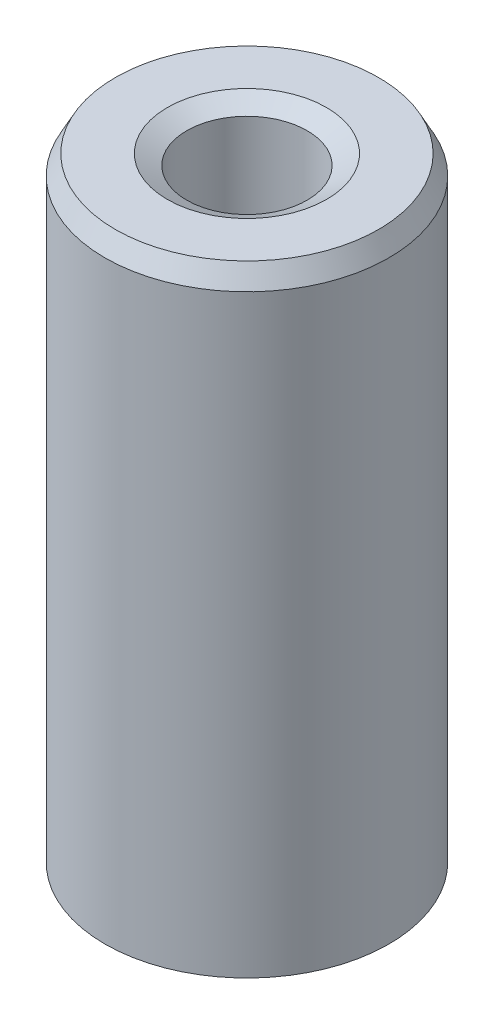
ISO-10303-21;
HEADER;
FILE_DESCRIPTION(('STEP AP214'),'2;1');
FILE_NAME('part.step','',(''),(''),'','','');
FILE_SCHEMA(('AUTOMOTIVE_DESIGN { 1 0 10303 214 1 1 1 1 }'));
ENDSEC;
DATA;
#1=APPLICATION_CONTEXT('core data for automotive mechanical design processes');
#2=APPLICATION_PROTOCOL_DEFINITION('international standard','automotive_design',2000,#1);
#3=PRODUCT_CONTEXT('',#1,'mechanical');
#4=PRODUCT('Part','Part','',(#3));
#5=PRODUCT_RELATED_PRODUCT_CATEGORY('part','',(#4));
#6=PRODUCT_DEFINITION_FORMATION('','',#4);
#7=PRODUCT_DEFINITION_CONTEXT('part definition',#1,'design');
#8=PRODUCT_DEFINITION('design','',#6,#7);
#9=PRODUCT_DEFINITION_SHAPE('','',#8);
#10=(LENGTH_UNIT() NAMED_UNIT(*) SI_UNIT(.MILLI.,.METRE.));
#11=(NAMED_UNIT(*) PLANE_ANGLE_UNIT() SI_UNIT($,.RADIAN.));
#12=(NAMED_UNIT(*) SI_UNIT($,.STERADIAN.) SOLID_ANGLE_UNIT());
#13=UNCERTAINTY_MEASURE_WITH_UNIT(LENGTH_MEASURE(1.E-05),#10,'distance_accuracy_value','');
#14=(GEOMETRIC_REPRESENTATION_CONTEXT(3) GLOBAL_UNCERTAINTY_ASSIGNED_CONTEXT((#13)) GLOBAL_UNIT_ASSIGNED_CONTEXT((#10,
#11,#12)) REPRESENTATION_CONTEXT('',''));
#15=CARTESIAN_POINT('',(0.,0.,0.));
#16=DIRECTION('',(0.,0.,1.));
#17=DIRECTION('',(1.,0.,0.));
#18=AXIS2_PLACEMENT_3D('',#15,#16,#17);
#19=CARTESIAN_POINT('',(0.,32.9641771289634,0.));
#20=DIRECTION('',(0.,-1.,0.));
#21=DIRECTION('',(0.,0.,-1.));
#22=AXIS2_PLACEMENT_3D('',#19,#20,#21);
#23=CYLINDRICAL_SURFACE('',#22,7.5);
#24=CARTESIAN_POINT('',(0.,0.54581456164688,0.));
#25=DIRECTION('',(0.,1.,0.));
#26=DIRECTION('',(0.,0.,1.));
#27=AXIS2_PLACEMENT_3D('',#24,#25,#26);
#28=CIRCLE('',#27,7.5);
#29=CARTESIAN_POINT('',(0.,0.54581456164688,7.5));
#30=VERTEX_POINT('',#29);
#31=EDGE_CURVE('E10',#30,#30,#28,.T.);
#32=ORIENTED_EDGE('',*,*,#31,.T.);
#33=EDGE_LOOP('',(#32));
#34=FACE_BOUND('',#33,.T.);
#35=CARTESIAN_POINT('',(0.,31.9389276027448,0.));
#36=DIRECTION('',(0.,1.,0.));
#37=DIRECTION('',(0.,0.,1.));
#38=AXIS2_PLACEMENT_3D('',#35,#36,#37);
#39=CIRCLE('',#38,7.5);
#40=CARTESIAN_POINT('',(0.,31.9389276027448,7.5));
#41=VERTEX_POINT('',#40);
#42=EDGE_CURVE('E50',#41,#41,#39,.F.);
#43=ORIENTED_EDGE('',*,*,#42,.T.);
#44=EDGE_LOOP('',(#43));
#45=FACE_BOUND('',#44,.T.);
#46=ADVANCED_FACE('F39',(#34,#45),#23,.T.);
#47=CARTESIAN_POINT('',(0.,32.9641771289634,0.));
#48=DIRECTION('',(0.,1.,0.));
#49=DIRECTION('',(0.,0.,1.));
#50=AXIS2_PLACEMENT_3D('',#47,#48,#49);
#51=PLANE('',#50);
#52=CARTESIAN_POINT('',(0.,32.9641771289634,0.));
#53=DIRECTION('',(0.,1.,0.));
#54=DIRECTION('',(0.,0.,1.));
#55=AXIS2_PLACEMENT_3D('',#52,#53,#54);
#56=CIRCLE('',#55,4.20689954573807);
#57=CARTESIAN_POINT('',(0.,32.9641771289634,4.20689954573807));
#58=VERTEX_POINT('',#57);
#59=EDGE_CURVE('E58',#58,#58,#56,.F.);
#60=ORIENTED_EDGE('',*,*,#59,.T.);
#61=EDGE_LOOP('',(#60));
#62=FACE_BOUND('',#61,.T.);
#63=CARTESIAN_POINT('',(0.,32.9641771289634,0.));
#64=DIRECTION('',(0.,1.,0.));
#65=DIRECTION('',(0.,0.,1.));
#66=AXIS2_PLACEMENT_3D('',#63,#64,#65);
#67=CIRCLE('',#66,6.95418543835312);
#68=CARTESIAN_POINT('',(0.,32.9641771289634,6.95418543835312));
#69=VERTEX_POINT('',#68);
#70=EDGE_CURVE('E61',#69,#69,#67,.T.);
#71=ORIENTED_EDGE('',*,*,#70,.T.);
#72=EDGE_LOOP('',(#71));
#73=FACE_BOUND('',#72,.T.);
#74=ADVANCED_FACE('F88',(#62,#73),#51,.T.);
#75=CARTESIAN_POINT('',(0.,0.,0.));
#76=DIRECTION('',(0.,1.,0.));
#77=DIRECTION('',(0.,0.,1.));
#78=AXIS2_PLACEMENT_3D('',#75,#76,#77);
#79=PLANE('',#78);
#80=CARTESIAN_POINT('',(0.,0.,0.));
#81=DIRECTION('',(0.,1.,0.));
#82=DIRECTION('',(0.,0.,1.));
#83=AXIS2_PLACEMENT_3D('',#80,#81,#82);
#84=CIRCLE('',#83,3.72746458116643);
#85=CARTESIAN_POINT('',(0.,0.,3.72746458116643));
#86=VERTEX_POINT('',#85);
#87=EDGE_CURVE('E51',#86,#86,#84,.T.);
#88=ORIENTED_EDGE('',*,*,#87,.T.);
#89=EDGE_LOOP('',(#88));
#90=FACE_BOUND('',#89,.T.);
#91=CARTESIAN_POINT('',(0.,0.,0.));
#92=DIRECTION('',(0.,1.,0.));
#93=DIRECTION('',(0.,0.,1.));
#94=AXIS2_PLACEMENT_3D('',#91,#92,#93);
#95=CIRCLE('',#94,6.47475047378148);
#96=CARTESIAN_POINT('',(0.,0.,6.47475047378148));
#97=VERTEX_POINT('',#96);
#98=EDGE_CURVE('E54',#97,#97,#95,.F.);
#99=ORIENTED_EDGE('',*,*,#98,.T.);
#100=EDGE_LOOP('',(#99));
#101=FACE_BOUND('',#100,.T.);
#102=ADVANCED_FACE('F83',(#90,#101),#79,.F.);
#103=CARTESIAN_POINT('',(0.,32.9641771289634,0.));
#104=DIRECTION('',(0.,-1.,0.));
#105=DIRECTION('',(0.,0.,-1.));
#106=AXIS2_PLACEMENT_3D('',#103,#104,#105);
#107=CYLINDRICAL_SURFACE('',#106,3.18165001951954);
#108=CARTESIAN_POINT('',(0.,32.4183625673165,0.));
#109=DIRECTION('',(0.,1.,0.));
#110=DIRECTION('',(0.,0.,1.));
#111=AXIS2_PLACEMENT_3D('',#108,#109,#110);
#112=CIRCLE('',#111,3.18165001951954);
#113=CARTESIAN_POINT('',(0.,32.4183625673165,3.18165001951954));
#114=VERTEX_POINT('',#113);
#115=EDGE_CURVE('E67',#114,#114,#112,.T.);
#116=ORIENTED_EDGE('',*,*,#115,.T.);
#117=EDGE_LOOP('',(#116));
#118=FACE_BOUND('',#117,.T.);
#119=CARTESIAN_POINT('',(0.,1.02524952621853,0.));
#120=DIRECTION('',(0.,1.,0.));
#121=DIRECTION('',(0.,0.,1.));
#122=AXIS2_PLACEMENT_3D('',#119,#120,#121);
#123=CIRCLE('',#122,3.18165001951954);
#124=CARTESIAN_POINT('',(0.,1.02524952621853,3.18165001951954));
#125=VERTEX_POINT('',#124);
#126=EDGE_CURVE('E69',#125,#125,#123,.F.);
#127=ORIENTED_EDGE('',*,*,#126,.T.);
#128=EDGE_LOOP('',(#127));
#129=FACE_BOUND('',#128,.T.);
#130=ADVANCED_FACE('F71',(#118,#129),#107,.F.);
#131=CARTESIAN_POINT('',(0.,32.4183625673165,0.));
#132=DIRECTION('',(0.,1.,0.));
#133=DIRECTION('',(0.,0.,1.));
#134=AXIS2_PLACEMENT_3D('',#131,#132,#133);
#135=CONICAL_SURFACE('',#134,3.18165001951954,1.0815874223267);
#136=ORIENTED_EDGE('',*,*,#59,.F.);
#137=EDGE_LOOP('',(#136));
#138=FACE_BOUND('',#137,.T.);
#139=ORIENTED_EDGE('',*,*,#115,.F.);
#140=EDGE_LOOP('',(#139));
#141=FACE_BOUND('',#140,.T.);
#142=ADVANCED_FACE('F77',(#138,#141),#135,.F.);
#143=CARTESIAN_POINT('',(0.,0.,0.));
#144=DIRECTION('',(0.,-1.,0.));
#145=DIRECTION('',(0.,0.,-1.));
#146=AXIS2_PLACEMENT_3D('',#143,#144,#145);
#147=CONICAL_SURFACE('',#146,3.72746458116643,0.489208904468196);
#148=ORIENTED_EDGE('',*,*,#126,.F.);
#149=EDGE_LOOP('',(#148));
#150=FACE_BOUND('',#149,.T.);
#151=ORIENTED_EDGE('',*,*,#87,.F.);
#152=EDGE_LOOP('',(#151));
#153=FACE_BOUND('',#152,.T.);
#154=ADVANCED_FACE('F73',(#150,#153),#147,.F.);
#155=CARTESIAN_POINT('',(0.,0.54581456164688,0.));
#156=DIRECTION('',(0.,1.,0.));
#157=DIRECTION('',(0.,0.,1.));
#158=AXIS2_PLACEMENT_3D('',#155,#156,#157);
#159=CONICAL_SURFACE('',#158,7.5,1.0815874223267);
#160=ORIENTED_EDGE('',*,*,#98,.F.);
#161=EDGE_LOOP('',(#160));
#162=FACE_BOUND('',#161,.T.);
#163=ORIENTED_EDGE('',*,*,#31,.F.);
#164=EDGE_LOOP('',(#163));
#165=FACE_BOUND('',#164,.T.);
#166=ADVANCED_FACE('F76',(#162,#165),#159,.T.);
#167=CARTESIAN_POINT('',(0.,32.9641771289634,0.));
#168=DIRECTION('',(0.,-1.,0.));
#169=DIRECTION('',(0.,0.,-1.));
#170=AXIS2_PLACEMENT_3D('',#167,#168,#169);
#171=CONICAL_SURFACE('',#170,6.95418543835312,0.489208904468195);
#172=ORIENTED_EDGE('',*,*,#42,.F.);
#173=EDGE_LOOP('',(#172));
#174=FACE_BOUND('',#173,.T.);
#175=ORIENTED_EDGE('',*,*,#70,.F.);
#176=EDGE_LOOP('',(#175));
#177=FACE_BOUND('',#176,.T.);
#178=ADVANCED_FACE('F45',(#174,#177),#171,.T.);
#179=CLOSED_SHELL('',(#46,#74,#102,#130,#142,#154,#166,#178));
#180=MANIFOLD_SOLID_BREP('B2',#179);
#181=ADVANCED_BREP_SHAPE_REPRESENTATION('',(#18,#180),#14);
#182=SHAPE_DEFINITION_REPRESENTATION(#9,#181);
ENDSEC;
END-ISO-10303-21;
